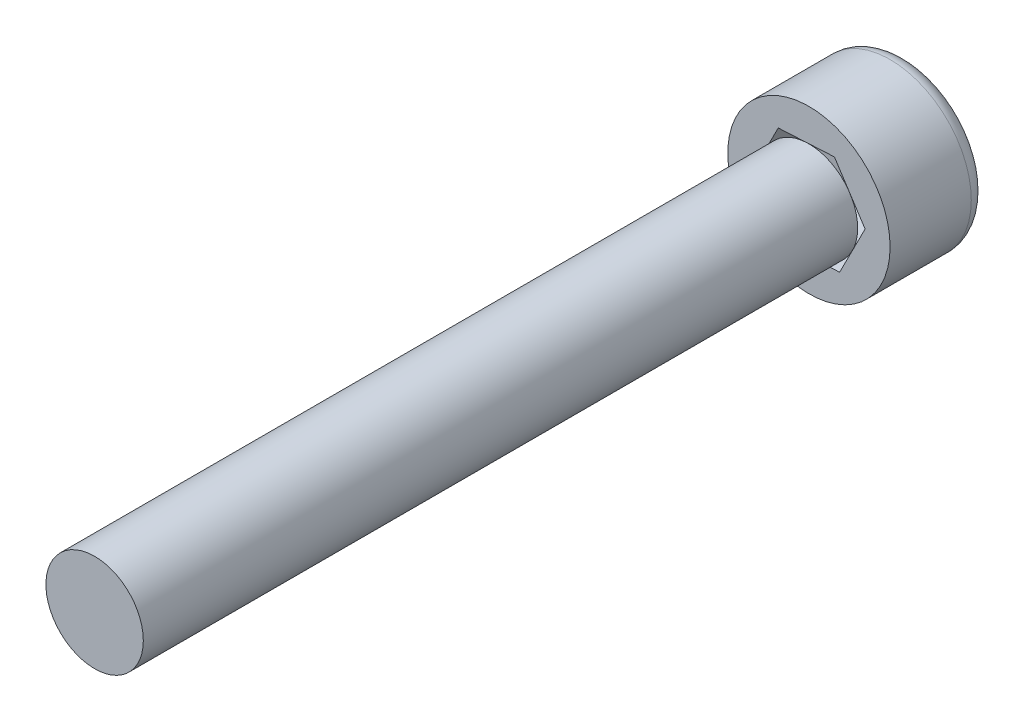
ISO-10303-21;
HEADER;
FILE_DESCRIPTION(('STEP AP214'),'2;1');
FILE_NAME('part.step','',(''),(''),'','','');
FILE_SCHEMA(('AUTOMOTIVE_DESIGN { 1 0 10303 214 1 1 1 1 }'));
ENDSEC;
DATA;
#1=APPLICATION_CONTEXT('core data for automotive mechanical design processes');
#2=APPLICATION_PROTOCOL_DEFINITION('international standard','automotive_design',2000,#1);
#3=PRODUCT_CONTEXT('',#1,'mechanical');
#4=PRODUCT('Part','Part','',(#3));
#5=PRODUCT_RELATED_PRODUCT_CATEGORY('part','',(#4));
#6=PRODUCT_DEFINITION_FORMATION('','',#4);
#7=PRODUCT_DEFINITION_CONTEXT('part definition',#1,'design');
#8=PRODUCT_DEFINITION('design','',#6,#7);
#9=PRODUCT_DEFINITION_SHAPE('','',#8);
#10=(LENGTH_UNIT() NAMED_UNIT(*) SI_UNIT(.MILLI.,.METRE.));
#11=(NAMED_UNIT(*) PLANE_ANGLE_UNIT() SI_UNIT($,.RADIAN.));
#12=(NAMED_UNIT(*) SI_UNIT($,.STERADIAN.) SOLID_ANGLE_UNIT());
#13=UNCERTAINTY_MEASURE_WITH_UNIT(LENGTH_MEASURE(1.E-05),#10,'distance_accuracy_value','');
#14=(GEOMETRIC_REPRESENTATION_CONTEXT(3) GLOBAL_UNCERTAINTY_ASSIGNED_CONTEXT((#13)) GLOBAL_UNIT_ASSIGNED_CONTEXT((#10,
#11,#12)) REPRESENTATION_CONTEXT('',''));
#15=CARTESIAN_POINT('',(0.,0.,0.));
#16=DIRECTION('',(0.,0.,1.));
#17=DIRECTION('',(1.,0.,0.));
#18=AXIS2_PLACEMENT_3D('',#15,#16,#17);
#19=CARTESIAN_POINT('',(0.,0.,3.));
#20=DIRECTION('',(0.,0.,-1.));
#21=DIRECTION('',(-1.,0.,0.));
#22=AXIS2_PLACEMENT_3D('',#19,#20,#21);
#23=CYLINDRICAL_SURFACE('',#22,2.5);
#24=CARTESIAN_POINT('',(0.,0.,0.5));
#25=DIRECTION('',(0.,0.,1.));
#26=DIRECTION('',(1.,0.,0.));
#27=AXIS2_PLACEMENT_3D('',#24,#25,#26);
#28=CIRCLE('',#27,2.5);
#29=CARTESIAN_POINT('',(2.5,0.,0.5));
#30=VERTEX_POINT('',#29);
#31=EDGE_CURVE('E49',#30,#30,#28,.T.);
#32=ORIENTED_EDGE('',*,*,#31,.T.);
#33=EDGE_LOOP('',(#32));
#34=FACE_BOUND('',#33,.T.);
#35=CARTESIAN_POINT('',(0.,0.,3.));
#36=DIRECTION('',(0.,0.,1.));
#37=DIRECTION('',(1.,0.,0.));
#38=AXIS2_PLACEMENT_3D('',#35,#36,#37);
#39=CIRCLE('',#38,2.5);
#40=CARTESIAN_POINT('',(2.5,0.,3.));
#41=VERTEX_POINT('',#40);
#42=EDGE_CURVE('E164',#41,#41,#39,.T.);
#43=ORIENTED_EDGE('',*,*,#42,.F.);
#44=EDGE_LOOP('',(#43));
#45=FACE_BOUND('',#44,.T.);
#46=ADVANCED_FACE('F40',(#34,#45),#23,.T.);
#47=CARTESIAN_POINT('',(0.,0.,3.));
#48=DIRECTION('',(0.,0.,1.));
#49=DIRECTION('',(1.,0.,0.));
#50=AXIS2_PLACEMENT_3D('',#47,#48,#49);
#51=PLANE('',#50);
#52=DIRECTION('',(-0.998565318577122,-0.0535472178079434,0.));
#53=VECTOR('',#52,1.);
#54=CARTESIAN_POINT('',(0.945103759937804,-1.45147472694203,3.));
#55=LINE('',#54,#53);
#56=CARTESIAN_POINT('',(0.945103759937804,-1.45147472694203,3.));
#57=VERTEX_POINT('',#56);
#58=CARTESIAN_POINT('',(-0.784462106513973,-1.54422122878934,3.));
#59=VERTEX_POINT('',#58);
#60=EDGE_CURVE('E93',#57,#59,#55,.T.);
#61=ORIENTED_EDGE('',*,*,#60,.T.);
#62=DIRECTION('',(-0.545655910212218,0.838009324321917,0.));
#63=VECTOR('',#62,1.);
#64=CARTESIAN_POINT('',(-0.784462106513973,-1.54422122878934,3.));
#65=LINE('',#64,#63);
#66=CARTESIAN_POINT('',(-1.72956586645178,-0.0927465018473138,3.));
#67=VERTEX_POINT('',#66);
#68=EDGE_CURVE('E56',#59,#67,#65,.T.);
#69=ORIENTED_EDGE('',*,*,#68,.T.);
#70=DIRECTION('',(0.452909408364904,0.89155654212986,0.));
#71=VECTOR('',#70,1.);
#72=CARTESIAN_POINT('',(-1.72956586645178,-0.0927465018473138,3.));
#73=LINE('',#72,#71);
#74=CARTESIAN_POINT('',(-0.945103759937803,1.45147472694203,3.));
#75=VERTEX_POINT('',#74);
#76=EDGE_CURVE('E103',#67,#75,#73,.T.);
#77=ORIENTED_EDGE('',*,*,#76,.T.);
#78=DIRECTION('',(0.998565318577122,0.0535472178079431,0.));
#79=VECTOR('',#78,1.);
#80=CARTESIAN_POINT('',(-0.945103759937803,1.45147472694203,3.));
#81=LINE('',#80,#79);
#82=CARTESIAN_POINT('',(0.784462106513974,1.54422122878934,3.));
#83=VERTEX_POINT('',#82);
#84=EDGE_CURVE('E175',#75,#83,#81,.T.);
#85=ORIENTED_EDGE('',*,*,#84,.T.);
#86=DIRECTION('',(0.545655910212218,-0.838009324321917,0.));
#87=VECTOR('',#86,1.);
#88=CARTESIAN_POINT('',(0.784462106513974,1.54422122878934,3.));
#89=LINE('',#88,#87);
#90=CARTESIAN_POINT('',(1.72956586645178,0.0927465018473145,3.));
#91=VERTEX_POINT('',#90);
#92=EDGE_CURVE('E173',#83,#91,#89,.T.);
#93=ORIENTED_EDGE('',*,*,#92,.T.);
#94=DIRECTION('',(-0.452909408364904,-0.89155654212986,0.));
#95=VECTOR('',#94,1.);
#96=CARTESIAN_POINT('',(1.72956586645178,0.0927465018473145,3.));
#97=LINE('',#96,#95);
#98=EDGE_CURVE('E108',#91,#57,#97,.T.);
#99=ORIENTED_EDGE('',*,*,#98,.T.);
#100=EDGE_LOOP('',(#61,#69,#77,#85,#93,#99));
#101=FACE_BOUND('',#100,.T.);
#102=ORIENTED_EDGE('',*,*,#42,.T.);
#103=EDGE_LOOP('',(#102));
#104=FACE_BOUND('',#103,.T.);
#105=ADVANCED_FACE('F105',(#101,#104),#51,.T.);
#106=CARTESIAN_POINT('',(0.,0.,0.));
#107=DIRECTION('',(0.,0.,1.));
#108=DIRECTION('',(1.,0.,0.));
#109=AXIS2_PLACEMENT_3D('',#106,#107,#108);
#110=PLANE('',#109);
#111=CARTESIAN_POINT('',(0.,0.,0.));
#112=DIRECTION('',(0.,0.,1.));
#113=DIRECTION('',(1.,0.,0.));
#114=AXIS2_PLACEMENT_3D('',#111,#112,#113);
#115=CIRCLE('',#114,2.);
#116=CARTESIAN_POINT('',(2.,0.,0.));
#117=VERTEX_POINT('',#116);
#118=EDGE_CURVE('E12',#117,#117,#115,.F.);
#119=ORIENTED_EDGE('',*,*,#118,.T.);
#120=EDGE_LOOP('',(#119));
#121=FACE_BOUND('',#120,.T.);
#122=DIRECTION('',(-0.545655910212218,0.838009324321917,0.));
#123=VECTOR('',#122,1.);
#124=CARTESIAN_POINT('',(-0.784462106513973,-1.54422122878934,0.));
#125=LINE('',#124,#123);
#126=CARTESIAN_POINT('',(-0.784462106513973,-1.54422122878934,0.));
#127=VERTEX_POINT('',#126);
#128=CARTESIAN_POINT('',(-1.72956586645178,-0.0927465018473138,0.));
#129=VERTEX_POINT('',#128);
#130=EDGE_CURVE('E98',#127,#129,#125,.T.);
#131=ORIENTED_EDGE('',*,*,#130,.F.);
#132=DIRECTION('',(-0.998565318577122,-0.0535472178079434,0.));
#133=VECTOR('',#132,1.);
#134=CARTESIAN_POINT('',(0.945103759937804,-1.45147472694203,0.));
#135=LINE('',#134,#133);
#136=CARTESIAN_POINT('',(0.945103759937804,-1.45147472694203,0.));
#137=VERTEX_POINT('',#136);
#138=EDGE_CURVE('E89',#137,#127,#135,.T.);
#139=ORIENTED_EDGE('',*,*,#138,.F.);
#140=DIRECTION('',(-0.452909408364904,-0.89155654212986,0.));
#141=VECTOR('',#140,1.);
#142=CARTESIAN_POINT('',(1.72956586645178,0.0927465018473145,0.));
#143=LINE('',#142,#141);
#144=CARTESIAN_POINT('',(1.72956586645178,0.0927465018473145,0.));
#145=VERTEX_POINT('',#144);
#146=EDGE_CURVE('E155',#145,#137,#143,.T.);
#147=ORIENTED_EDGE('',*,*,#146,.F.);
#148=DIRECTION('',(0.545655910212218,-0.838009324321917,0.));
#149=VECTOR('',#148,1.);
#150=CARTESIAN_POINT('',(0.784462106513974,1.54422122878934,0.));
#151=LINE('',#150,#149);
#152=CARTESIAN_POINT('',(0.784462106513974,1.54422122878934,0.));
#153=VERTEX_POINT('',#152);
#154=EDGE_CURVE('E188',#153,#145,#151,.T.);
#155=ORIENTED_EDGE('',*,*,#154,.F.);
#156=DIRECTION('',(0.998565318577122,0.0535472178079431,0.));
#157=VECTOR('',#156,1.);
#158=CARTESIAN_POINT('',(-0.945103759937803,1.45147472694203,0.));
#159=LINE('',#158,#157);
#160=CARTESIAN_POINT('',(-0.945103759937803,1.45147472694203,0.));
#161=VERTEX_POINT('',#160);
#162=EDGE_CURVE('E184',#161,#153,#159,.T.);
#163=ORIENTED_EDGE('',*,*,#162,.F.);
#164=DIRECTION('',(0.452909408364904,0.89155654212986,0.));
#165=VECTOR('',#164,1.);
#166=CARTESIAN_POINT('',(-1.72956586645178,-0.0927465018473138,0.));
#167=LINE('',#166,#165);
#168=EDGE_CURVE('E181',#129,#161,#167,.T.);
#169=ORIENTED_EDGE('',*,*,#168,.F.);
#170=EDGE_LOOP('',(#131,#139,#147,#155,#163,#169));
#171=FACE_BOUND('',#170,.T.);
#172=ADVANCED_FACE('F130',(#121,#171),#110,.F.);
#173=CARTESIAN_POINT('',(0.945103759937804,-1.45147472694203,3.));
#174=DIRECTION('',(0.0535472178079434,-0.998565318577122,0.));
#175=DIRECTION('',(0.998565318577122,0.0535472178079434,0.));
#176=AXIS2_PLACEMENT_3D('',#173,#174,#175);
#177=PLANE('',#176);
#178=ORIENTED_EDGE('',*,*,#138,.T.);
#179=DIRECTION('',(0.,0.,-1.));
#180=VECTOR('',#179,1.);
#181=CARTESIAN_POINT('',(-0.784462106513973,-1.54422122878934,3.));
#182=LINE('',#181,#180);
#183=EDGE_CURVE('E91',#59,#127,#182,.T.);
#184=ORIENTED_EDGE('',*,*,#183,.F.);
#185=ORIENTED_EDGE('',*,*,#60,.F.);
#186=DIRECTION('',(0.,0.,-1.));
#187=VECTOR('',#186,1.);
#188=CARTESIAN_POINT('',(0.945103759937804,-1.45147472694203,3.));
#189=LINE('',#188,#187);
#190=EDGE_CURVE('E156',#57,#137,#189,.T.);
#191=ORIENTED_EDGE('',*,*,#190,.T.);
#192=EDGE_LOOP('',(#178,#184,#185,#191));
#193=FACE_BOUND('',#192,.T.);
#194=ADVANCED_FACE('F92',(#193),#177,.F.);
#195=CARTESIAN_POINT('',(1.72956586645178,0.0927465018473145,3.));
#196=DIRECTION('',(0.89155654212986,-0.452909408364904,0.));
#197=DIRECTION('',(0.452909408364904,0.89155654212986,0.));
#198=AXIS2_PLACEMENT_3D('',#195,#196,#197);
#199=PLANE('',#198);
#200=ORIENTED_EDGE('',*,*,#146,.T.);
#201=ORIENTED_EDGE('',*,*,#190,.F.);
#202=ORIENTED_EDGE('',*,*,#98,.F.);
#203=DIRECTION('',(0.,0.,-1.));
#204=VECTOR('',#203,1.);
#205=CARTESIAN_POINT('',(1.72956586645178,0.0927465018473145,3.));
#206=LINE('',#205,#204);
#207=EDGE_CURVE('E158',#91,#145,#206,.T.);
#208=ORIENTED_EDGE('',*,*,#207,.T.);
#209=EDGE_LOOP('',(#200,#201,#202,#208));
#210=FACE_BOUND('',#209,.T.);
#211=ADVANCED_FACE('F137',(#210),#199,.F.);
#212=CARTESIAN_POINT('',(0.784462106513974,1.54422122878934,3.));
#213=DIRECTION('',(0.838009324321917,0.545655910212218,0.));
#214=DIRECTION('',(-0.545655910212218,0.838009324321917,0.));
#215=AXIS2_PLACEMENT_3D('',#212,#213,#214);
#216=PLANE('',#215);
#217=ORIENTED_EDGE('',*,*,#154,.T.);
#218=ORIENTED_EDGE('',*,*,#207,.F.);
#219=ORIENTED_EDGE('',*,*,#92,.F.);
#220=DIRECTION('',(0.,0.,-1.));
#221=VECTOR('',#220,1.);
#222=CARTESIAN_POINT('',(0.784462106513974,1.54422122878934,3.));
#223=LINE('',#222,#221);
#224=EDGE_CURVE('E186',#83,#153,#223,.T.);
#225=ORIENTED_EDGE('',*,*,#224,.T.);
#226=EDGE_LOOP('',(#217,#218,#219,#225));
#227=FACE_BOUND('',#226,.T.);
#228=ADVANCED_FACE('F145',(#227),#216,.F.);
#229=CARTESIAN_POINT('',(-0.945103759937803,1.45147472694203,3.));
#230=DIRECTION('',(-0.0535472178079431,0.998565318577122,0.));
#231=DIRECTION('',(-0.998565318577122,-0.0535472178079432,0.));
#232=AXIS2_PLACEMENT_3D('',#229,#230,#231);
#233=PLANE('',#232);
#234=ORIENTED_EDGE('',*,*,#162,.T.);
#235=ORIENTED_EDGE('',*,*,#224,.F.);
#236=ORIENTED_EDGE('',*,*,#84,.F.);
#237=DIRECTION('',(0.,0.,-1.));
#238=VECTOR('',#237,1.);
#239=CARTESIAN_POINT('',(-0.945103759937803,1.45147472694203,3.));
#240=LINE('',#239,#238);
#241=EDGE_CURVE('E180',#75,#161,#240,.T.);
#242=ORIENTED_EDGE('',*,*,#241,.T.);
#243=EDGE_LOOP('',(#234,#235,#236,#242));
#244=FACE_BOUND('',#243,.T.);
#245=ADVANCED_FACE('F141',(#244),#233,.F.);
#246=CARTESIAN_POINT('',(-1.72956586645178,-0.0927465018473138,3.));
#247=DIRECTION('',(-0.89155654212986,0.452909408364904,0.));
#248=DIRECTION('',(-0.452909408364904,-0.89155654212986,0.));
#249=AXIS2_PLACEMENT_3D('',#246,#247,#248);
#250=PLANE('',#249);
#251=ORIENTED_EDGE('',*,*,#168,.T.);
#252=ORIENTED_EDGE('',*,*,#241,.F.);
#253=ORIENTED_EDGE('',*,*,#76,.F.);
#254=DIRECTION('',(0.,0.,-1.));
#255=VECTOR('',#254,1.);
#256=CARTESIAN_POINT('',(-1.72956586645178,-0.0927465018473138,3.));
#257=LINE('',#256,#255);
#258=EDGE_CURVE('E101',#67,#129,#257,.T.);
#259=ORIENTED_EDGE('',*,*,#258,.T.);
#260=EDGE_LOOP('',(#251,#252,#253,#259));
#261=FACE_BOUND('',#260,.T.);
#262=ADVANCED_FACE('F122',(#261),#250,.F.);
#263=CARTESIAN_POINT('',(-0.784462106513973,-1.54422122878934,3.));
#264=DIRECTION('',(-0.838009324321917,-0.545655910212218,0.));
#265=DIRECTION('',(0.545655910212218,-0.838009324321917,0.));
#266=AXIS2_PLACEMENT_3D('',#263,#264,#265);
#267=PLANE('',#266);
#268=ORIENTED_EDGE('',*,*,#130,.T.);
#269=ORIENTED_EDGE('',*,*,#258,.F.);
#270=ORIENTED_EDGE('',*,*,#68,.F.);
#271=ORIENTED_EDGE('',*,*,#183,.T.);
#272=EDGE_LOOP('',(#268,#269,#270,#271));
#273=FACE_BOUND('',#272,.T.);
#274=ADVANCED_FACE('F100',(#273),#267,.F.);
#275=CARTESIAN_POINT('',(0.,0.,0.5));
#276=DIRECTION('',(0.,0.,1.));
#277=DIRECTION('',(1.,0.,0.));
#278=AXIS2_PLACEMENT_3D('',#275,#276,#277);
#279=TOROIDAL_SURFACE('',#278,2.,0.5);
#280=ORIENTED_EDGE('',*,*,#118,.F.);
#281=EDGE_LOOP('',(#280));
#282=FACE_BOUND('',#281,.T.);
#283=ORIENTED_EDGE('',*,*,#31,.F.);
#284=EDGE_LOOP('',(#283));
#285=FACE_BOUND('',#284,.T.);
#286=ADVANCED_FACE('F42',(#282,#285),#279,.T.);
#287=CLOSED_SHELL('',(#46,#105,#172,#194,#211,#228,#245,#262,#274,#286));
#288=MANIFOLD_SOLID_BREP('B2',#287);
#289=CARTESIAN_POINT('',(0.,0.,25.));
#290=DIRECTION('',(0.,0.,1.));
#291=DIRECTION('',(1.,0.,0.));
#292=AXIS2_PLACEMENT_3D('',#289,#290,#291);
#293=PLANE('',#292);
#294=CARTESIAN_POINT('',(0.,0.,25.));
#295=DIRECTION('',(0.,0.,1.));
#296=DIRECTION('',(1.,0.,0.));
#297=AXIS2_PLACEMENT_3D('',#294,#295,#296);
#298=CIRCLE('',#297,1.5);
#299=CARTESIAN_POINT('',(1.5,0.,25.));
#300=VERTEX_POINT('',#299);
#301=EDGE_CURVE('E258',#300,#300,#298,.T.);
#302=ORIENTED_EDGE('',*,*,#301,.T.);
#303=EDGE_LOOP('',(#302));
#304=FACE_BOUND('',#303,.T.);
#305=ADVANCED_FACE('F251',(#304),#293,.T.);
#306=CARTESIAN_POINT('',(0.,0.,25.));
#307=DIRECTION('',(0.,0.,-1.));
#308=DIRECTION('',(-1.,0.,0.));
#309=AXIS2_PLACEMENT_3D('',#306,#307,#308);
#310=CYLINDRICAL_SURFACE('',#309,1.5);
#311=ORIENTED_EDGE('',*,*,#301,.F.);
#312=EDGE_LOOP('',(#311));
#313=FACE_BOUND('',#312,.T.);
#314=CARTESIAN_POINT('',(0.,0.,3.));
#315=DIRECTION('',(0.,0.,1.));
#316=DIRECTION('',(1.,0.,0.));
#317=AXIS2_PLACEMENT_3D('',#314,#315,#316);
#318=CIRCLE('',#317,1.5);
#319=CARTESIAN_POINT('',(1.5,0.,3.));
#320=VERTEX_POINT('',#319);
#321=EDGE_CURVE('E39',#320,#320,#318,.T.);
#322=ORIENTED_EDGE('',*,*,#321,.T.);
#323=EDGE_LOOP('',(#322));
#324=FACE_BOUND('',#323,.T.);
#325=ADVANCED_FACE('F253',(#313,#324),#310,.T.);
#326=CARTESIAN_POINT('',(0.,0.,3.));
#327=DIRECTION('',(0.,0.,-1.));
#328=DIRECTION('',(-1.,0.,0.));
#329=AXIS2_PLACEMENT_3D('',#326,#327,#328);
#330=PLANE('',#329);
#331=ORIENTED_EDGE('',*,*,#321,.F.);
#332=EDGE_LOOP('',(#331));
#333=FACE_BOUND('',#332,.T.);
#334=ADVANCED_FACE('F266',(#333),#330,.T.);
#335=CLOSED_SHELL('',(#305,#325,#334));
#336=MANIFOLD_SOLID_BREP('B6',#335);
#337=ADVANCED_BREP_SHAPE_REPRESENTATION('',(#18,#288,#336),#14);
#338=SHAPE_DEFINITION_REPRESENTATION(#9,#337);
ENDSEC;
END-ISO-10303-21;
